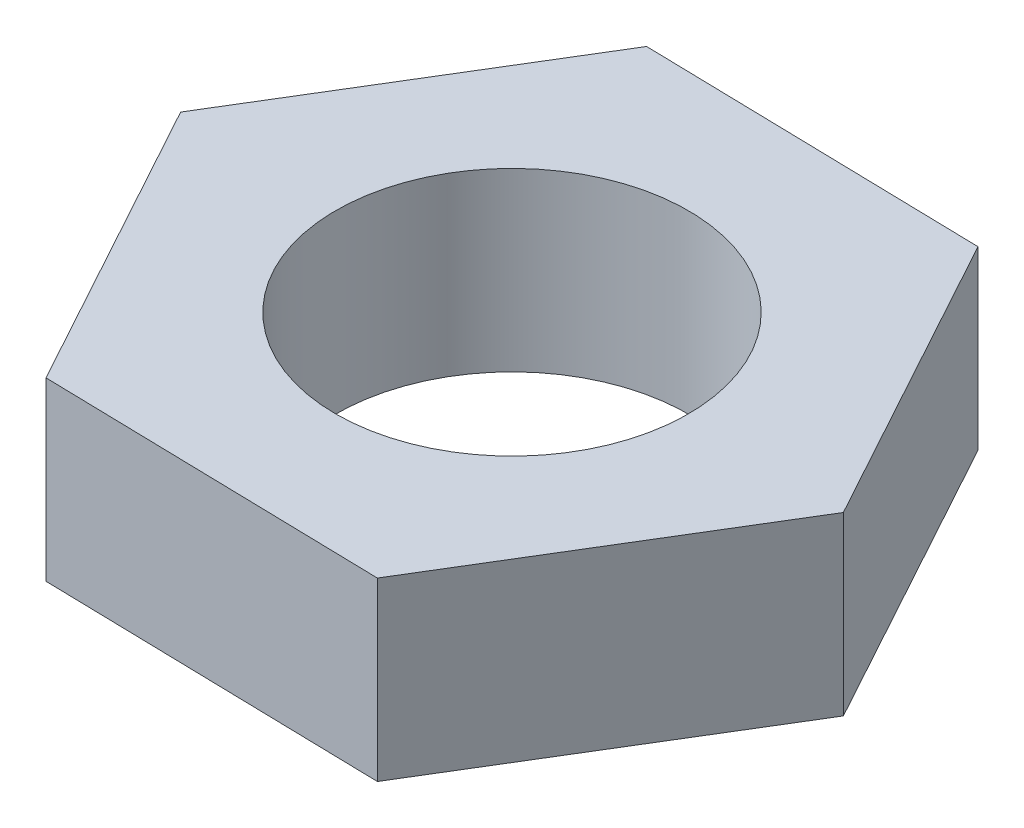
ISO-10303-21;
HEADER;
FILE_DESCRIPTION(('STEP AP214'),'2;1');
FILE_NAME('part.step','',(''),(''),'','','');
FILE_SCHEMA(('AUTOMOTIVE_DESIGN { 1 0 10303 214 1 1 1 1 }'));
ENDSEC;
DATA;
#1=APPLICATION_CONTEXT('core data for automotive mechanical design processes');
#2=APPLICATION_PROTOCOL_DEFINITION('international standard','automotive_design',2000,#1);
#3=PRODUCT_CONTEXT('',#1,'mechanical');
#4=PRODUCT('Part','Part','',(#3));
#5=PRODUCT_RELATED_PRODUCT_CATEGORY('part','',(#4));
#6=PRODUCT_DEFINITION_FORMATION('','',#4);
#7=PRODUCT_DEFINITION_CONTEXT('part definition',#1,'design');
#8=PRODUCT_DEFINITION('design','',#6,#7);
#9=PRODUCT_DEFINITION_SHAPE('','',#8);
#10=(LENGTH_UNIT() NAMED_UNIT(*) SI_UNIT(.MILLI.,.METRE.));
#11=(NAMED_UNIT(*) PLANE_ANGLE_UNIT() SI_UNIT($,.RADIAN.));
#12=(NAMED_UNIT(*) SI_UNIT($,.STERADIAN.) SOLID_ANGLE_UNIT());
#13=UNCERTAINTY_MEASURE_WITH_UNIT(LENGTH_MEASURE(1.E-05),#10,'distance_accuracy_value','');
#14=(GEOMETRIC_REPRESENTATION_CONTEXT(3) GLOBAL_UNCERTAINTY_ASSIGNED_CONTEXT((#13)) GLOBAL_UNIT_ASSIGNED_CONTEXT((#10,
#11,#12)) REPRESENTATION_CONTEXT('',''));
#15=CARTESIAN_POINT('',(0.,0.,0.));
#16=DIRECTION('',(0.,0.,1.));
#17=DIRECTION('',(1.,0.,0.));
#18=AXIS2_PLACEMENT_3D('',#15,#16,#17);
#19=CARTESIAN_POINT('',(-9.24199865078262,10.,-16.882875792672));
#20=DIRECTION('',(0.854432646606362,0.,0.519562173770616));
#21=DIRECTION('',(0.519562173770616,0.,-0.854432646606362));
#22=AXIS2_PLACEMENT_3D('',#19,#20,#21);
#23=PLANE('',#22);
#24=DIRECTION('',(-0.519562173770616,0.,0.854432646606362));
#25=VECTOR('',#24,1.);
#26=CARTESIAN_POINT('',(-9.24199865078262,0.,-16.882875792672));
#27=LINE('',#26,#25);
#28=CARTESIAN_POINT('',(-9.24199865078262,0.,-16.882875792672));
#29=VERTEX_POINT('',#28);
#30=CARTESIAN_POINT('',(-19.2419986507826,0.,-0.437632283016742));
#31=VERTEX_POINT('',#30);
#32=EDGE_CURVE('E118',#29,#31,#27,.T.);
#33=ORIENTED_EDGE('',*,*,#32,.T.);
#34=DIRECTION('',(0.,-1.,0.));
#35=VECTOR('',#34,1.);
#36=CARTESIAN_POINT('',(-19.2419986507826,10.,-0.437632283016742));
#37=LINE('',#36,#35);
#38=CARTESIAN_POINT('',(-19.2419986507826,10.,-0.437632283016742));
#39=VERTEX_POINT('',#38);
#40=EDGE_CURVE('E11',#39,#31,#37,.T.);
#41=ORIENTED_EDGE('',*,*,#40,.F.);
#42=DIRECTION('',(-0.519562173770616,0.,0.854432646606362));
#43=VECTOR('',#42,1.);
#44=CARTESIAN_POINT('',(-9.24199865078262,10.,-16.882875792672));
#45=LINE('',#44,#43);
#46=CARTESIAN_POINT('',(-9.24199865078262,10.,-16.882875792672));
#47=VERTEX_POINT('',#46);
#48=EDGE_CURVE('E129',#47,#39,#45,.T.);
#49=ORIENTED_EDGE('',*,*,#48,.F.);
#50=DIRECTION('',(0.,-1.,0.));
#51=VECTOR('',#50,1.);
#52=CARTESIAN_POINT('',(-9.24199865078262,10.,-16.882875792672));
#53=LINE('',#52,#51);
#54=EDGE_CURVE('E114',#47,#29,#53,.T.);
#55=ORIENTED_EDGE('',*,*,#54,.T.);
#56=EDGE_LOOP('',(#33,#41,#49,#55));
#57=FACE_BOUND('',#56,.T.);
#58=ADVANCED_FACE('F34',(#57),#23,.F.);
#59=CARTESIAN_POINT('',(-19.2419986507826,10.,-0.437632283016742));
#60=DIRECTION('',(0.877170364634,0.,-0.480179290898573));
#61=DIRECTION('',(-0.480179290898573,0.,-0.877170364634));
#62=AXIS2_PLACEMENT_3D('',#59,#60,#61);
#63=PLANE('',#62);
#64=DIRECTION('',(0.480179290898573,0.,0.877170364634));
#65=VECTOR('',#64,1.);
#66=CARTESIAN_POINT('',(-19.2419986507826,0.,-0.437632283016742));
#67=LINE('',#66,#65);
#68=CARTESIAN_POINT('',(-9.99999999999999,0.,16.4452435096553));
#69=VERTEX_POINT('',#68);
#70=EDGE_CURVE('E121',#31,#69,#67,.T.);
#71=ORIENTED_EDGE('',*,*,#70,.T.);
#72=DIRECTION('',(0.,-1.,0.));
#73=VECTOR('',#72,1.);
#74=CARTESIAN_POINT('',(-9.99999999999999,10.,16.4452435096553));
#75=LINE('',#74,#73);
#76=CARTESIAN_POINT('',(-9.99999999999999,10.,16.4452435096553));
#77=VERTEX_POINT('',#76);
#78=EDGE_CURVE('E42',#77,#69,#75,.T.);
#79=ORIENTED_EDGE('',*,*,#78,.F.);
#80=DIRECTION('',(0.480179290898573,0.,0.877170364634));
#81=VECTOR('',#80,1.);
#82=CARTESIAN_POINT('',(-19.2419986507826,10.,-0.437632283016742));
#83=LINE('',#82,#81);
#84=EDGE_CURVE('E87',#39,#77,#83,.T.);
#85=ORIENTED_EDGE('',*,*,#84,.F.);
#86=ORIENTED_EDGE('',*,*,#40,.T.);
#87=EDGE_LOOP('',(#71,#79,#85,#86));
#88=FACE_BOUND('',#87,.T.);
#89=ADVANCED_FACE('F154',(#88),#63,.F.);
#90=CARTESIAN_POINT('',(-9.99999999999999,10.,16.4452435096553));
#91=DIRECTION('',(0.0227377180276382,0.,-0.999741464669189));
#92=DIRECTION('',(-0.999741464669189,0.,-0.0227377180276382));
#93=AXIS2_PLACEMENT_3D('',#90,#91,#92);
#94=PLANE('',#93);
#95=DIRECTION('',(0.999741464669189,0.,0.0227377180276382));
#96=VECTOR('',#95,1.);
#97=CARTESIAN_POINT('',(-9.99999999999999,0.,16.4452435096553));
#98=LINE('',#97,#96);
#99=CARTESIAN_POINT('',(9.24199865078263,0.,16.882875792672));
#100=VERTEX_POINT('',#99);
#101=EDGE_CURVE('E124',#69,#100,#98,.T.);
#102=ORIENTED_EDGE('',*,*,#101,.T.);
#103=DIRECTION('',(0.,-1.,0.));
#104=VECTOR('',#103,1.);
#105=CARTESIAN_POINT('',(9.24199865078263,10.,16.882875792672));
#106=LINE('',#105,#104);
#107=CARTESIAN_POINT('',(9.24199865078263,10.,16.882875792672));
#108=VERTEX_POINT('',#107);
#109=EDGE_CURVE('E109',#108,#100,#106,.T.);
#110=ORIENTED_EDGE('',*,*,#109,.F.);
#111=DIRECTION('',(0.999741464669189,0.,0.0227377180276382));
#112=VECTOR('',#111,1.);
#113=CARTESIAN_POINT('',(-9.99999999999999,10.,16.4452435096553));
#114=LINE('',#113,#112);
#115=EDGE_CURVE('E100',#77,#108,#114,.T.);
#116=ORIENTED_EDGE('',*,*,#115,.F.);
#117=ORIENTED_EDGE('',*,*,#78,.T.);
#118=EDGE_LOOP('',(#102,#110,#116,#117));
#119=FACE_BOUND('',#118,.T.);
#120=ADVANCED_FACE('F135',(#119),#94,.F.);
#121=CARTESIAN_POINT('',(9.24199865078263,10.,16.882875792672));
#122=DIRECTION('',(-0.854432646606362,0.,-0.519562173770616));
#123=DIRECTION('',(-0.519562173770616,0.,0.854432646606362));
#124=AXIS2_PLACEMENT_3D('',#121,#122,#123);
#125=PLANE('',#124);
#126=DIRECTION('',(0.519562173770616,0.,-0.854432646606362));
#127=VECTOR('',#126,1.);
#128=CARTESIAN_POINT('',(9.24199865078263,0.,16.882875792672));
#129=LINE('',#128,#127);
#130=CARTESIAN_POINT('',(19.2419986507826,0.,0.437632283016739));
#131=VERTEX_POINT('',#130);
#132=EDGE_CURVE('E108',#100,#131,#129,.T.);
#133=ORIENTED_EDGE('',*,*,#132,.T.);
#134=DIRECTION('',(0.,-1.,0.));
#135=VECTOR('',#134,1.);
#136=CARTESIAN_POINT('',(19.2419986507826,10.,0.437632283016739));
#137=LINE('',#136,#135);
#138=CARTESIAN_POINT('',(19.2419986507826,10.,0.437632283016739));
#139=VERTEX_POINT('',#138);
#140=EDGE_CURVE('E105',#139,#131,#137,.T.);
#141=ORIENTED_EDGE('',*,*,#140,.F.);
#142=DIRECTION('',(0.519562173770616,0.,-0.854432646606362));
#143=VECTOR('',#142,1.);
#144=CARTESIAN_POINT('',(9.24199865078263,10.,16.882875792672));
#145=LINE('',#144,#143);
#146=EDGE_CURVE('E94',#108,#139,#145,.T.);
#147=ORIENTED_EDGE('',*,*,#146,.F.);
#148=ORIENTED_EDGE('',*,*,#109,.T.);
#149=EDGE_LOOP('',(#133,#141,#147,#148));
#150=FACE_BOUND('',#149,.T.);
#151=ADVANCED_FACE('F106',(#150),#125,.F.);
#152=CARTESIAN_POINT('',(19.2419986507826,10.,0.437632283016739));
#153=DIRECTION('',(-0.877170364634,0.,0.480179290898573));
#154=DIRECTION('',(0.480179290898573,0.,0.877170364634));
#155=AXIS2_PLACEMENT_3D('',#152,#153,#154);
#156=PLANE('',#155);
#157=DIRECTION('',(-0.480179290898573,0.,-0.877170364634));
#158=VECTOR('',#157,1.);
#159=CARTESIAN_POINT('',(19.2419986507826,0.,0.437632283016739));
#160=LINE('',#159,#158);
#161=CARTESIAN_POINT('',(10.,0.,-16.4452435096553));
#162=VERTEX_POINT('',#161);
#163=EDGE_CURVE('E73',#131,#162,#160,.T.);
#164=ORIENTED_EDGE('',*,*,#163,.T.);
#165=DIRECTION('',(0.,-1.,0.));
#166=VECTOR('',#165,1.);
#167=CARTESIAN_POINT('',(10.,10.,-16.4452435096553));
#168=LINE('',#167,#166);
#169=CARTESIAN_POINT('',(10.,10.,-16.4452435096553));
#170=VERTEX_POINT('',#169);
#171=EDGE_CURVE('E110',#170,#162,#168,.T.);
#172=ORIENTED_EDGE('',*,*,#171,.F.);
#173=DIRECTION('',(-0.480179290898573,0.,-0.877170364634));
#174=VECTOR('',#173,1.);
#175=CARTESIAN_POINT('',(19.2419986507826,10.,0.437632283016739));
#176=LINE('',#175,#174);
#177=EDGE_CURVE('E98',#139,#170,#176,.T.);
#178=ORIENTED_EDGE('',*,*,#177,.F.);
#179=ORIENTED_EDGE('',*,*,#140,.T.);
#180=EDGE_LOOP('',(#164,#172,#178,#179));
#181=FACE_BOUND('',#180,.T.);
#182=ADVANCED_FACE('F112',(#181),#156,.F.);
#183=CARTESIAN_POINT('',(10.,10.,-16.4452435096553));
#184=DIRECTION('',(-0.0227377180276382,0.,0.999741464669189));
#185=DIRECTION('',(0.999741464669189,0.,0.0227377180276382));
#186=AXIS2_PLACEMENT_3D('',#183,#184,#185);
#187=PLANE('',#186);
#188=DIRECTION('',(-0.999741464669189,0.,-0.0227377180276382));
#189=VECTOR('',#188,1.);
#190=CARTESIAN_POINT('',(10.,0.,-16.4452435096553));
#191=LINE('',#190,#189);
#192=EDGE_CURVE('E79',#162,#29,#191,.T.);
#193=ORIENTED_EDGE('',*,*,#192,.T.);
#194=ORIENTED_EDGE('',*,*,#54,.F.);
#195=DIRECTION('',(-0.999741464669189,0.,-0.0227377180276382));
#196=VECTOR('',#195,1.);
#197=CARTESIAN_POINT('',(10.,10.,-16.4452435096553));
#198=LINE('',#197,#196);
#199=EDGE_CURVE('E50',#170,#47,#198,.T.);
#200=ORIENTED_EDGE('',*,*,#199,.F.);
#201=ORIENTED_EDGE('',*,*,#171,.T.);
#202=EDGE_LOOP('',(#193,#194,#200,#201));
#203=FACE_BOUND('',#202,.T.);
#204=ADVANCED_FACE('F142',(#203),#187,.F.);
#205=CARTESIAN_POINT('',(0.,10.,0.));
#206=DIRECTION('',(0.,1.,0.));
#207=DIRECTION('',(0.,0.,1.));
#208=AXIS2_PLACEMENT_3D('',#205,#206,#207);
#209=PLANE('',#208);
#210=CARTESIAN_POINT('',(0.,10.,0.));
#211=DIRECTION('',(0.,1.,0.));
#212=DIRECTION('',(0.,0.,1.));
#213=AXIS2_PLACEMENT_3D('',#210,#211,#212);
#214=CIRCLE('',#213,10.);
#215=CARTESIAN_POINT('',(0.,10.,10.));
#216=VERTEX_POINT('',#215);
#217=EDGE_CURVE('E211',#216,#216,#214,.T.);
#218=ORIENTED_EDGE('',*,*,#217,.F.);
#219=EDGE_LOOP('',(#218));
#220=FACE_BOUND('',#219,.T.);
#221=ORIENTED_EDGE('',*,*,#48,.T.);
#222=ORIENTED_EDGE('',*,*,#84,.T.);
#223=ORIENTED_EDGE('',*,*,#115,.T.);
#224=ORIENTED_EDGE('',*,*,#146,.T.);
#225=ORIENTED_EDGE('',*,*,#177,.T.);
#226=ORIENTED_EDGE('',*,*,#199,.T.);
#227=EDGE_LOOP('',(#221,#222,#223,#224,#225,#226));
#228=FACE_BOUND('',#227,.T.);
#229=ADVANCED_FACE('F96',(#220,#228),#209,.T.);
#230=CARTESIAN_POINT('',(0.,0.,0.));
#231=DIRECTION('',(0.,1.,0.));
#232=DIRECTION('',(0.,0.,1.));
#233=AXIS2_PLACEMENT_3D('',#230,#231,#232);
#234=PLANE('',#233);
#235=CARTESIAN_POINT('',(0.,0.,0.));
#236=DIRECTION('',(0.,1.,0.));
#237=DIRECTION('',(0.,0.,1.));
#238=AXIS2_PLACEMENT_3D('',#235,#236,#237);
#239=CIRCLE('',#238,10.);
#240=CARTESIAN_POINT('',(0.,0.,10.));
#241=VERTEX_POINT('',#240);
#242=EDGE_CURVE('E122',#241,#241,#239,.T.);
#243=ORIENTED_EDGE('',*,*,#242,.T.);
#244=EDGE_LOOP('',(#243));
#245=FACE_BOUND('',#244,.T.);
#246=ORIENTED_EDGE('',*,*,#32,.F.);
#247=ORIENTED_EDGE('',*,*,#192,.F.);
#248=ORIENTED_EDGE('',*,*,#163,.F.);
#249=ORIENTED_EDGE('',*,*,#132,.F.);
#250=ORIENTED_EDGE('',*,*,#101,.F.);
#251=ORIENTED_EDGE('',*,*,#70,.F.);
#252=EDGE_LOOP('',(#246,#247,#248,#249,#250,#251));
#253=FACE_BOUND('',#252,.T.);
#254=ADVANCED_FACE('F138',(#245,#253),#234,.F.);
#255=CARTESIAN_POINT('',(0.,0.,0.));
#256=DIRECTION('',(0.,1.,0.));
#257=DIRECTION('',(0.,0.,1.));
#258=AXIS2_PLACEMENT_3D('',#255,#256,#257);
#259=CYLINDRICAL_SURFACE('',#258,10.);
#260=ORIENTED_EDGE('',*,*,#242,.F.);
#261=EDGE_LOOP('',(#260));
#262=FACE_BOUND('',#261,.T.);
#263=ORIENTED_EDGE('',*,*,#217,.T.);
#264=EDGE_LOOP('',(#263));
#265=FACE_BOUND('',#264,.T.);
#266=ADVANCED_FACE('F191',(#262,#265),#259,.F.);
#267=CLOSED_SHELL('',(#58,#89,#120,#151,#182,#204,#229,#254,#266));
#268=MANIFOLD_SOLID_BREP('B2',#267);
#269=ADVANCED_BREP_SHAPE_REPRESENTATION('',(#18,#268),#14);
#270=SHAPE_DEFINITION_REPRESENTATION(#9,#269);
ENDSEC;
END-ISO-10303-21;
